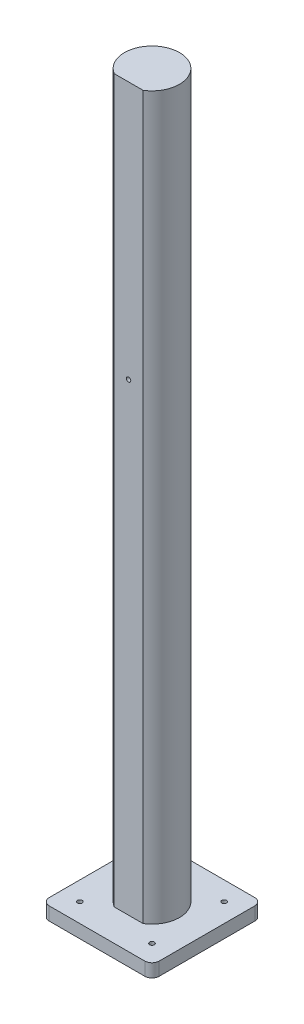
ISO-10303-21;
HEADER;
FILE_DESCRIPTION(('STEP AP214'),'2;1');
FILE_NAME('part.step','',(''),(''),'','','');
FILE_SCHEMA(('AUTOMOTIVE_DESIGN { 1 0 10303 214 1 1 1 1 }'));
ENDSEC;
DATA;
#1=APPLICATION_CONTEXT('core data for automotive mechanical design processes');
#2=APPLICATION_PROTOCOL_DEFINITION('international standard','automotive_design',2000,#1);
#3=PRODUCT_CONTEXT('',#1,'mechanical');
#4=PRODUCT('Part','Part','',(#3));
#5=PRODUCT_RELATED_PRODUCT_CATEGORY('part','',(#4));
#6=PRODUCT_DEFINITION_FORMATION('','',#4);
#7=PRODUCT_DEFINITION_CONTEXT('part definition',#1,'design');
#8=PRODUCT_DEFINITION('design','',#6,#7);
#9=PRODUCT_DEFINITION_SHAPE('','',#8);
#10=(LENGTH_UNIT() NAMED_UNIT(*) SI_UNIT(.MILLI.,.METRE.));
#11=(NAMED_UNIT(*) PLANE_ANGLE_UNIT() SI_UNIT($,.RADIAN.));
#12=(NAMED_UNIT(*) SI_UNIT($,.STERADIAN.) SOLID_ANGLE_UNIT());
#13=UNCERTAINTY_MEASURE_WITH_UNIT(LENGTH_MEASURE(1.E-05),#10,'distance_accuracy_value','');
#14=(GEOMETRIC_REPRESENTATION_CONTEXT(3) GLOBAL_UNCERTAINTY_ASSIGNED_CONTEXT((#13)) GLOBAL_UNIT_ASSIGNED_CONTEXT((#10,
#11,#12)) REPRESENTATION_CONTEXT('',''));
#15=CARTESIAN_POINT('',(0.,0.,0.));
#16=DIRECTION('',(0.,0.,1.));
#17=DIRECTION('',(1.,0.,0.));
#18=AXIS2_PLACEMENT_3D('',#15,#16,#17);
#19=CARTESIAN_POINT('',(0.,500.,0.));
#20=DIRECTION('',(0.,-1.,0.));
#21=DIRECTION('',(0.,0.,-1.));
#22=AXIS2_PLACEMENT_3D('',#19,#20,#21);
#23=CYLINDRICAL_SURFACE('',#22,19.05);
#24=CARTESIAN_POINT('',(0.,0.,0.));
#25=DIRECTION('',(0.,1.,0.));
#26=DIRECTION('',(0.,0.,1.));
#27=AXIS2_PLACEMENT_3D('',#24,#25,#26);
#28=CIRCLE('',#27,19.05);
#29=CARTESIAN_POINT('',(10.,0.,16.2142684077944));
#30=VERTEX_POINT('',#29);
#31=CARTESIAN_POINT('',(-10.,0.,16.2142684077944));
#32=VERTEX_POINT('',#31);
#33=EDGE_CURVE('E122',#30,#32,#28,.T.);
#34=ORIENTED_EDGE('',*,*,#33,.T.);
#35=DIRECTION('',(0.,-1.,0.));
#36=VECTOR('',#35,1.);
#37=CARTESIAN_POINT('',(-10.,500.,16.2142684077944));
#38=LINE('',#37,#36);
#39=CARTESIAN_POINT('',(-10.,500.,16.2142684077944));
#40=VERTEX_POINT('',#39);
#41=EDGE_CURVE('E129',#40,#32,#38,.T.);
#42=ORIENTED_EDGE('',*,*,#41,.F.);
#43=CARTESIAN_POINT('',(0.,500.,0.));
#44=DIRECTION('',(0.,1.,0.));
#45=DIRECTION('',(0.,0.,1.));
#46=AXIS2_PLACEMENT_3D('',#43,#44,#45);
#47=CIRCLE('',#46,19.05);
#48=CARTESIAN_POINT('',(10.,500.,16.2142684077944));
#49=VERTEX_POINT('',#48);
#50=EDGE_CURVE('E126',#49,#40,#47,.T.);
#51=ORIENTED_EDGE('',*,*,#50,.F.);
#52=DIRECTION('',(0.,-1.,0.));
#53=VECTOR('',#52,1.);
#54=CARTESIAN_POINT('',(10.,500.,16.2142684077944));
#55=LINE('',#54,#53);
#56=EDGE_CURVE('E136',#49,#30,#55,.T.);
#57=ORIENTED_EDGE('',*,*,#56,.T.);
#58=EDGE_LOOP('',(#34,#42,#51,#57));
#59=FACE_BOUND('',#58,.T.);
#60=ADVANCED_FACE('F40',(#59),#23,.T.);
#61=CARTESIAN_POINT('',(-10.,500.,16.2142684077944));
#62=DIRECTION('',(0.,0.,-1.));
#63=DIRECTION('',(-1.,0.,0.));
#64=AXIS2_PLACEMENT_3D('',#61,#62,#63);
#65=PLANE('',#64);
#66=CARTESIAN_POINT('',(0.,321.4,16.2142684077944));
#67=DIRECTION('',(0.,0.,1.));
#68=DIRECTION('',(1.,0.,0.));
#69=AXIS2_PLACEMENT_3D('',#66,#67,#68);
#70=CIRCLE('',#69,1.5);
#71=CARTESIAN_POINT('',(1.5,321.4,16.2142684077944));
#72=VERTEX_POINT('',#71);
#73=EDGE_CURVE('E141',#72,#72,#70,.T.);
#74=ORIENTED_EDGE('',*,*,#73,.F.);
#75=EDGE_LOOP('',(#74));
#76=FACE_BOUND('',#75,.T.);
#77=DIRECTION('',(1.,0.,0.));
#78=VECTOR('',#77,1.);
#79=CARTESIAN_POINT('',(-10.,0.,16.2142684077944));
#80=LINE('',#79,#78);
#81=EDGE_CURVE('E118',#32,#30,#80,.T.);
#82=ORIENTED_EDGE('',*,*,#81,.T.);
#83=ORIENTED_EDGE('',*,*,#56,.F.);
#84=DIRECTION('',(1.,0.,0.));
#85=VECTOR('',#84,1.);
#86=CARTESIAN_POINT('',(-10.,500.,16.2142684077944));
#87=LINE('',#86,#85);
#88=EDGE_CURVE('E131',#40,#49,#87,.T.);
#89=ORIENTED_EDGE('',*,*,#88,.F.);
#90=ORIENTED_EDGE('',*,*,#41,.T.);
#91=EDGE_LOOP('',(#82,#83,#89,#90));
#92=FACE_BOUND('',#91,.T.);
#93=ADVANCED_FACE('F130',(#76,#92),#65,.F.);
#94=CARTESIAN_POINT('',(0.,500.,0.));
#95=DIRECTION('',(0.,1.,0.));
#96=DIRECTION('',(0.,0.,1.));
#97=AXIS2_PLACEMENT_3D('',#94,#95,#96);
#98=PLANE('',#97);
#99=ORIENTED_EDGE('',*,*,#50,.T.);
#100=ORIENTED_EDGE('',*,*,#88,.T.);
#101=EDGE_LOOP('',(#99,#100));
#102=FACE_BOUND('',#101,.T.);
#103=ADVANCED_FACE('F214',(#102),#98,.T.);
#104=CARTESIAN_POINT('',(0.,321.4,11.2142684077944));
#105=DIRECTION('',(0.,0.,1.));
#106=DIRECTION('',(1.,0.,0.));
#107=AXIS2_PLACEMENT_3D('',#104,#105,#106);
#108=CYLINDRICAL_SURFACE('',#107,1.5);
#109=CARTESIAN_POINT('',(0.,321.4,11.2142684077944));
#110=DIRECTION('',(0.,0.,1.));
#111=DIRECTION('',(1.,0.,0.));
#112=AXIS2_PLACEMENT_3D('',#109,#110,#111);
#113=CIRCLE('',#112,1.5);
#114=CARTESIAN_POINT('',(1.5,321.4,11.2142684077944));
#115=VERTEX_POINT('',#114);
#116=EDGE_CURVE('E138',#115,#115,#113,.T.);
#117=ORIENTED_EDGE('',*,*,#116,.F.);
#118=EDGE_LOOP('',(#117));
#119=FACE_BOUND('',#118,.T.);
#120=ORIENTED_EDGE('',*,*,#73,.T.);
#121=EDGE_LOOP('',(#120));
#122=FACE_BOUND('',#121,.T.);
#123=ADVANCED_FACE('F216',(#119,#122),#108,.F.);
#124=CARTESIAN_POINT('',(0.,321.4,11.2142684077944));
#125=DIRECTION('',(0.,0.,1.));
#126=DIRECTION('',(1.,0.,0.));
#127=AXIS2_PLACEMENT_3D('',#124,#125,#126);
#128=PLANE('',#127);
#129=ORIENTED_EDGE('',*,*,#116,.T.);
#130=EDGE_LOOP('',(#129));
#131=FACE_BOUND('',#130,.T.);
#132=ADVANCED_FACE('F222',(#131),#128,.T.);
#133=CARTESIAN_POINT('',(0.,0.,0.));
#134=DIRECTION('',(0.,1.,0.));
#135=DIRECTION('',(0.,0.,1.));
#136=AXIS2_PLACEMENT_3D('',#133,#134,#135);
#137=PLANE('',#136);
#138=CARTESIAN_POINT('',(-25.,0.,-25.));
#139=DIRECTION('',(0.,1.,0.));
#140=DIRECTION('',(0.,0.,1.));
#141=AXIS2_PLACEMENT_3D('',#138,#139,#140);
#142=CIRCLE('',#141,1.65);
#143=CARTESIAN_POINT('',(-25.,0.,-23.35));
#144=VERTEX_POINT('',#143);
#145=EDGE_CURVE('E268',#144,#144,#142,.F.);
#146=ORIENTED_EDGE('',*,*,#145,.T.);
#147=EDGE_LOOP('',(#146));
#148=FACE_BOUND('',#147,.T.);
#149=CARTESIAN_POINT('',(25.,0.,25.));
#150=DIRECTION('',(0.,1.,0.));
#151=DIRECTION('',(0.,0.,1.));
#152=AXIS2_PLACEMENT_3D('',#149,#150,#151);
#153=CIRCLE('',#152,1.65);
#154=CARTESIAN_POINT('',(25.,0.,26.65));
#155=VERTEX_POINT('',#154);
#156=EDGE_CURVE('E269',#155,#155,#153,.F.);
#157=ORIENTED_EDGE('',*,*,#156,.T.);
#158=EDGE_LOOP('',(#157));
#159=FACE_BOUND('',#158,.T.);
#160=CARTESIAN_POINT('',(25.,0.,-25.));
#161=DIRECTION('',(0.,1.,0.));
#162=DIRECTION('',(0.,0.,1.));
#163=AXIS2_PLACEMENT_3D('',#160,#161,#162);
#164=CIRCLE('',#163,1.65);
#165=CARTESIAN_POINT('',(25.,0.,-23.35));
#166=VERTEX_POINT('',#165);
#167=EDGE_CURVE('E279',#166,#166,#164,.F.);
#168=ORIENTED_EDGE('',*,*,#167,.T.);
#169=EDGE_LOOP('',(#168));
#170=FACE_BOUND('',#169,.T.);
#171=CARTESIAN_POINT('',(-25.,0.,25.));
#172=DIRECTION('',(0.,1.,0.));
#173=DIRECTION('',(0.,0.,1.));
#174=AXIS2_PLACEMENT_3D('',#171,#172,#173);
#175=CIRCLE('',#174,1.65);
#176=CARTESIAN_POINT('',(-25.,0.,26.65));
#177=VERTEX_POINT('',#176);
#178=EDGE_CURVE('E206',#177,#177,#175,.F.);
#179=ORIENTED_EDGE('',*,*,#178,.T.);
#180=EDGE_LOOP('',(#179));
#181=FACE_BOUND('',#180,.T.);
#182=DIRECTION('',(0.,0.,-1.));
#183=VECTOR('',#182,1.);
#184=CARTESIAN_POINT('',(-38.1,0.,-38.1));
#185=LINE('',#184,#183);
#186=CARTESIAN_POINT('',(-38.1,0.,33.1));
#187=VERTEX_POINT('',#186);
#188=CARTESIAN_POINT('',(-38.1,0.,-33.1));
#189=VERTEX_POINT('',#188);
#190=EDGE_CURVE('E202',#187,#189,#185,.T.);
#191=ORIENTED_EDGE('',*,*,#190,.F.);
#192=CARTESIAN_POINT('',(-33.1,0.,33.1));
#193=DIRECTION('',(0.,1.,0.));
#194=DIRECTION('',(0.,0.,1.));
#195=AXIS2_PLACEMENT_3D('',#192,#193,#194);
#196=CIRCLE('',#195,5.);
#197=CARTESIAN_POINT('',(-33.1,0.,38.1));
#198=VERTEX_POINT('',#197);
#199=EDGE_CURVE('E157',#187,#198,#196,.T.);
#200=ORIENTED_EDGE('',*,*,#199,.T.);
#201=DIRECTION('',(-1.,0.,0.));
#202=VECTOR('',#201,1.);
#203=CARTESIAN_POINT('',(-38.1,0.,38.1));
#204=LINE('',#203,#202);
#205=CARTESIAN_POINT('',(33.1,0.,38.1));
#206=VERTEX_POINT('',#205);
#207=EDGE_CURVE('E198',#206,#198,#204,.T.);
#208=ORIENTED_EDGE('',*,*,#207,.F.);
#209=CARTESIAN_POINT('',(33.1,0.,33.1));
#210=DIRECTION('',(0.,1.,0.));
#211=DIRECTION('',(0.,0.,1.));
#212=AXIS2_PLACEMENT_3D('',#209,#210,#211);
#213=CIRCLE('',#212,5.);
#214=CARTESIAN_POINT('',(38.1,0.,33.1));
#215=VERTEX_POINT('',#214);
#216=EDGE_CURVE('E151',#206,#215,#213,.T.);
#217=ORIENTED_EDGE('',*,*,#216,.T.);
#218=DIRECTION('',(0.,0.,1.));
#219=VECTOR('',#218,1.);
#220=CARTESIAN_POINT('',(38.1,0.,-38.1));
#221=LINE('',#220,#219);
#222=CARTESIAN_POINT('',(38.1,0.,-33.1));
#223=VERTEX_POINT('',#222);
#224=EDGE_CURVE('E183',#223,#215,#221,.T.);
#225=ORIENTED_EDGE('',*,*,#224,.F.);
#226=CARTESIAN_POINT('',(33.1,0.,-33.1));
#227=DIRECTION('',(0.,1.,0.));
#228=DIRECTION('',(0.,0.,1.));
#229=AXIS2_PLACEMENT_3D('',#226,#227,#228);
#230=CIRCLE('',#229,5.);
#231=CARTESIAN_POINT('',(33.1,0.,-38.1));
#232=VERTEX_POINT('',#231);
#233=EDGE_CURVE('E153',#223,#232,#230,.T.);
#234=ORIENTED_EDGE('',*,*,#233,.T.);
#235=DIRECTION('',(1.,0.,0.));
#236=VECTOR('',#235,1.);
#237=CARTESIAN_POINT('',(-38.1,0.,-38.1));
#238=LINE('',#237,#236);
#239=CARTESIAN_POINT('',(-33.1,0.,-38.1));
#240=VERTEX_POINT('',#239);
#241=EDGE_CURVE('E191',#240,#232,#238,.T.);
#242=ORIENTED_EDGE('',*,*,#241,.F.);
#243=CARTESIAN_POINT('',(-33.1,0.,-33.1));
#244=DIRECTION('',(0.,1.,0.));
#245=DIRECTION('',(0.,0.,1.));
#246=AXIS2_PLACEMENT_3D('',#243,#244,#245);
#247=CIRCLE('',#246,5.);
#248=EDGE_CURVE('E155',#240,#189,#247,.T.);
#249=ORIENTED_EDGE('',*,*,#248,.T.);
#250=EDGE_LOOP('',(#191,#200,#208,#217,#225,#234,#242,#249));
#251=FACE_BOUND('',#250,.T.);
#252=ORIENTED_EDGE('',*,*,#33,.F.);
#253=ORIENTED_EDGE('',*,*,#81,.F.);
#254=EDGE_LOOP('',(#252,#253));
#255=FACE_BOUND('',#254,.T.);
#256=ADVANCED_FACE('F120',(#148,#159,#170,#181,#251,#255),#137,.T.);
#257=CARTESIAN_POINT('',(38.1,-9.144,-38.1));
#258=DIRECTION('',(-1.,0.,0.));
#259=DIRECTION('',(0.,0.,1.));
#260=AXIS2_PLACEMENT_3D('',#257,#258,#259);
#261=PLANE('',#260);
#262=DIRECTION('',(0.,0.,1.));
#263=VECTOR('',#262,1.);
#264=CARTESIAN_POINT('',(38.1,-9.144,-38.1));
#265=LINE('',#264,#263);
#266=CARTESIAN_POINT('',(38.1,-9.144,-33.1));
#267=VERTEX_POINT('',#266);
#268=CARTESIAN_POINT('',(38.1,-9.144,33.1));
#269=VERTEX_POINT('',#268);
#270=EDGE_CURVE('E180',#267,#269,#265,.T.);
#271=ORIENTED_EDGE('',*,*,#270,.F.);
#272=DIRECTION('',(0.,1.,0.));
#273=VECTOR('',#272,1.);
#274=CARTESIAN_POINT('',(38.1,-9.144,-33.1));
#275=LINE('',#274,#273);
#276=EDGE_CURVE('E11',#267,#223,#275,.T.);
#277=ORIENTED_EDGE('',*,*,#276,.T.);
#278=ORIENTED_EDGE('',*,*,#224,.T.);
#279=DIRECTION('',(0.,1.,0.));
#280=VECTOR('',#279,1.);
#281=CARTESIAN_POINT('',(38.1,-9.144,33.1));
#282=LINE('',#281,#280);
#283=EDGE_CURVE('E48',#215,#269,#282,.F.);
#284=ORIENTED_EDGE('',*,*,#283,.T.);
#285=EDGE_LOOP('',(#271,#277,#278,#284));
#286=FACE_BOUND('',#285,.T.);
#287=ADVANCED_FACE('F179',(#286),#261,.F.);
#288=CARTESIAN_POINT('',(-38.1,-9.144,38.1));
#289=DIRECTION('',(0.,0.,-1.));
#290=DIRECTION('',(-1.,0.,0.));
#291=AXIS2_PLACEMENT_3D('',#288,#289,#290);
#292=PLANE('',#291);
#293=ORIENTED_EDGE('',*,*,#207,.T.);
#294=DIRECTION('',(0.,1.,0.));
#295=VECTOR('',#294,1.);
#296=CARTESIAN_POINT('',(-33.1,-9.144,38.1));
#297=LINE('',#296,#295);
#298=CARTESIAN_POINT('',(-33.1,-9.144,38.1));
#299=VERTEX_POINT('',#298);
#300=EDGE_CURVE('E162',#198,#299,#297,.F.);
#301=ORIENTED_EDGE('',*,*,#300,.T.);
#302=DIRECTION('',(-1.,0.,0.));
#303=VECTOR('',#302,1.);
#304=CARTESIAN_POINT('',(-38.1,-9.144,38.1));
#305=LINE('',#304,#303);
#306=CARTESIAN_POINT('',(33.1,-9.144,38.1));
#307=VERTEX_POINT('',#306);
#308=EDGE_CURVE('E190',#307,#299,#305,.T.);
#309=ORIENTED_EDGE('',*,*,#308,.F.);
#310=DIRECTION('',(0.,1.,0.));
#311=VECTOR('',#310,1.);
#312=CARTESIAN_POINT('',(33.1,-9.144,38.1));
#313=LINE('',#312,#311);
#314=EDGE_CURVE('E159',#307,#206,#313,.T.);
#315=ORIENTED_EDGE('',*,*,#314,.T.);
#316=EDGE_LOOP('',(#293,#301,#309,#315));
#317=FACE_BOUND('',#316,.T.);
#318=ADVANCED_FACE('F197',(#317),#292,.F.);
#319=CARTESIAN_POINT('',(-38.1,-9.144,-38.1));
#320=DIRECTION('',(1.,0.,0.));
#321=DIRECTION('',(0.,0.,-1.));
#322=AXIS2_PLACEMENT_3D('',#319,#320,#321);
#323=PLANE('',#322);
#324=DIRECTION('',(0.,0.,-1.));
#325=VECTOR('',#324,1.);
#326=CARTESIAN_POINT('',(-38.1,-9.144,-38.1));
#327=LINE('',#326,#325);
#328=CARTESIAN_POINT('',(-38.1,-9.144,33.1));
#329=VERTEX_POINT('',#328);
#330=CARTESIAN_POINT('',(-38.1,-9.144,-33.1));
#331=VERTEX_POINT('',#330);
#332=EDGE_CURVE('E254',#329,#331,#327,.T.);
#333=ORIENTED_EDGE('',*,*,#332,.F.);
#334=DIRECTION('',(0.,1.,0.));
#335=VECTOR('',#334,1.);
#336=CARTESIAN_POINT('',(-38.1,-9.144,33.1));
#337=LINE('',#336,#335);
#338=EDGE_CURVE('E148',#329,#187,#337,.T.);
#339=ORIENTED_EDGE('',*,*,#338,.T.);
#340=ORIENTED_EDGE('',*,*,#190,.T.);
#341=DIRECTION('',(0.,1.,0.));
#342=VECTOR('',#341,1.);
#343=CARTESIAN_POINT('',(-38.1,-9.144,-33.1));
#344=LINE('',#343,#342);
#345=EDGE_CURVE('E135',#189,#331,#344,.F.);
#346=ORIENTED_EDGE('',*,*,#345,.T.);
#347=EDGE_LOOP('',(#333,#339,#340,#346));
#348=FACE_BOUND('',#347,.T.);
#349=ADVANCED_FACE('F252',(#348),#323,.F.);
#350=CARTESIAN_POINT('',(-38.1,-9.144,-38.1));
#351=DIRECTION('',(0.,0.,1.));
#352=DIRECTION('',(1.,0.,0.));
#353=AXIS2_PLACEMENT_3D('',#350,#351,#352);
#354=PLANE('',#353);
#355=DIRECTION('',(1.,0.,0.));
#356=VECTOR('',#355,1.);
#357=CARTESIAN_POINT('',(-38.1,-9.144,-38.1));
#358=LINE('',#357,#356);
#359=CARTESIAN_POINT('',(-33.1,-9.144,-38.1));
#360=VERTEX_POINT('',#359);
#361=CARTESIAN_POINT('',(33.1,-9.144,-38.1));
#362=VERTEX_POINT('',#361);
#363=EDGE_CURVE('E212',#360,#362,#358,.T.);
#364=ORIENTED_EDGE('',*,*,#363,.F.);
#365=DIRECTION('',(0.,1.,0.));
#366=VECTOR('',#365,1.);
#367=CARTESIAN_POINT('',(-33.1,-9.144,-38.1));
#368=LINE('',#367,#366);
#369=EDGE_CURVE('E172',#360,#240,#368,.T.);
#370=ORIENTED_EDGE('',*,*,#369,.T.);
#371=ORIENTED_EDGE('',*,*,#241,.T.);
#372=DIRECTION('',(0.,1.,0.));
#373=VECTOR('',#372,1.);
#374=CARTESIAN_POINT('',(33.1,-9.144,-38.1));
#375=LINE('',#374,#373);
#376=EDGE_CURVE('E55',#232,#362,#375,.F.);
#377=ORIENTED_EDGE('',*,*,#376,.T.);
#378=EDGE_LOOP('',(#364,#370,#371,#377));
#379=FACE_BOUND('',#378,.T.);
#380=ADVANCED_FACE('F247',(#379),#354,.F.);
#381=CARTESIAN_POINT('',(0.,-9.144,0.));
#382=DIRECTION('',(0.,1.,0.));
#383=DIRECTION('',(0.,0.,1.));
#384=AXIS2_PLACEMENT_3D('',#381,#382,#383);
#385=PLANE('',#384);
#386=CARTESIAN_POINT('',(-25.,-9.144,-25.));
#387=DIRECTION('',(0.,-1.,0.));
#388=DIRECTION('',(0.,0.,-1.));
#389=AXIS2_PLACEMENT_3D('',#386,#387,#388);
#390=CIRCLE('',#389,1.65);
#391=CARTESIAN_POINT('',(-25.,-9.144,-26.65));
#392=VERTEX_POINT('',#391);
#393=EDGE_CURVE('E264',#392,#392,#390,.T.);
#394=ORIENTED_EDGE('',*,*,#393,.F.);
#395=EDGE_LOOP('',(#394));
#396=FACE_BOUND('',#395,.T.);
#397=CARTESIAN_POINT('',(25.,-9.144,25.));
#398=DIRECTION('',(0.,-1.,0.));
#399=DIRECTION('',(0.,0.,-1.));
#400=AXIS2_PLACEMENT_3D('',#397,#398,#399);
#401=CIRCLE('',#400,1.65);
#402=CARTESIAN_POINT('',(25.,-9.144,23.35));
#403=VERTEX_POINT('',#402);
#404=EDGE_CURVE('E265',#403,#403,#401,.T.);
#405=ORIENTED_EDGE('',*,*,#404,.F.);
#406=EDGE_LOOP('',(#405));
#407=FACE_BOUND('',#406,.T.);
#408=CARTESIAN_POINT('',(25.,-9.144,-25.));
#409=DIRECTION('',(0.,-1.,0.));
#410=DIRECTION('',(0.,0.,-1.));
#411=AXIS2_PLACEMENT_3D('',#408,#409,#410);
#412=CIRCLE('',#411,1.65);
#413=CARTESIAN_POINT('',(25.,-9.144,-26.65));
#414=VERTEX_POINT('',#413);
#415=EDGE_CURVE('E272',#414,#414,#412,.T.);
#416=ORIENTED_EDGE('',*,*,#415,.F.);
#417=EDGE_LOOP('',(#416));
#418=FACE_BOUND('',#417,.T.);
#419=CARTESIAN_POINT('',(-25.,-9.144,25.));
#420=DIRECTION('',(0.,-1.,0.));
#421=DIRECTION('',(0.,0.,-1.));
#422=AXIS2_PLACEMENT_3D('',#419,#420,#421);
#423=CIRCLE('',#422,1.65);
#424=CARTESIAN_POINT('',(-25.,-9.144,23.35));
#425=VERTEX_POINT('',#424);
#426=EDGE_CURVE('E261',#425,#425,#423,.T.);
#427=ORIENTED_EDGE('',*,*,#426,.F.);
#428=EDGE_LOOP('',(#427));
#429=FACE_BOUND('',#428,.T.);
#430=ORIENTED_EDGE('',*,*,#308,.T.);
#431=CARTESIAN_POINT('',(-33.1,-9.144,33.1));
#432=DIRECTION('',(0.,1.,0.));
#433=DIRECTION('',(0.,0.,1.));
#434=AXIS2_PLACEMENT_3D('',#431,#432,#433);
#435=CIRCLE('',#434,5.);
#436=EDGE_CURVE('E169',#299,#329,#435,.F.);
#437=ORIENTED_EDGE('',*,*,#436,.T.);
#438=ORIENTED_EDGE('',*,*,#332,.T.);
#439=CARTESIAN_POINT('',(-33.1,-9.144,-33.1));
#440=DIRECTION('',(0.,1.,0.));
#441=DIRECTION('',(0.,0.,1.));
#442=AXIS2_PLACEMENT_3D('',#439,#440,#441);
#443=CIRCLE('',#442,5.);
#444=EDGE_CURVE('E62',#331,#360,#443,.F.);
#445=ORIENTED_EDGE('',*,*,#444,.T.);
#446=ORIENTED_EDGE('',*,*,#363,.T.);
#447=CARTESIAN_POINT('',(33.1,-9.144,-33.1));
#448=DIRECTION('',(0.,1.,0.));
#449=DIRECTION('',(0.,0.,1.));
#450=AXIS2_PLACEMENT_3D('',#447,#448,#449);
#451=CIRCLE('',#450,5.);
#452=EDGE_CURVE('E166',#362,#267,#451,.F.);
#453=ORIENTED_EDGE('',*,*,#452,.T.);
#454=ORIENTED_EDGE('',*,*,#270,.T.);
#455=CARTESIAN_POINT('',(33.1,-9.144,33.1));
#456=DIRECTION('',(0.,1.,0.));
#457=DIRECTION('',(0.,0.,1.));
#458=AXIS2_PLACEMENT_3D('',#455,#456,#457);
#459=CIRCLE('',#458,5.);
#460=EDGE_CURVE('E164',#269,#307,#459,.F.);
#461=ORIENTED_EDGE('',*,*,#460,.T.);
#462=EDGE_LOOP('',(#430,#437,#438,#445,#446,#453,#454,#461));
#463=FACE_BOUND('',#462,.T.);
#464=ADVANCED_FACE('F187',(#396,#407,#418,#429,#463),#385,.F.);
#465=CARTESIAN_POINT('',(-25.,4.66690475583121,25.));
#466=DIRECTION('',(0.,-1.,0.));
#467=DIRECTION('',(0.,0.,-1.));
#468=AXIS2_PLACEMENT_3D('',#465,#466,#467);
#469=CYLINDRICAL_SURFACE('',#468,1.65);
#470=ORIENTED_EDGE('',*,*,#426,.T.);
#471=EDGE_LOOP('',(#470));
#472=FACE_BOUND('',#471,.T.);
#473=ORIENTED_EDGE('',*,*,#178,.F.);
#474=EDGE_LOOP('',(#473));
#475=FACE_BOUND('',#474,.T.);
#476=ADVANCED_FACE('F288',(#472,#475),#469,.F.);
#477=CARTESIAN_POINT('',(25.,4.66690475583121,-25.));
#478=DIRECTION('',(0.,-1.,0.));
#479=DIRECTION('',(0.,0.,-1.));
#480=AXIS2_PLACEMENT_3D('',#477,#478,#479);
#481=CYLINDRICAL_SURFACE('',#480,1.65);
#482=ORIENTED_EDGE('',*,*,#415,.T.);
#483=EDGE_LOOP('',(#482));
#484=FACE_BOUND('',#483,.T.);
#485=ORIENTED_EDGE('',*,*,#167,.F.);
#486=EDGE_LOOP('',(#485));
#487=FACE_BOUND('',#486,.T.);
#488=ADVANCED_FACE('F285',(#484,#487),#481,.F.);
#489=CARTESIAN_POINT('',(25.,4.66690475583121,25.));
#490=DIRECTION('',(0.,-1.,0.));
#491=DIRECTION('',(0.,0.,-1.));
#492=AXIS2_PLACEMENT_3D('',#489,#490,#491);
#493=CYLINDRICAL_SURFACE('',#492,1.65);
#494=ORIENTED_EDGE('',*,*,#404,.T.);
#495=EDGE_LOOP('',(#494));
#496=FACE_BOUND('',#495,.T.);
#497=ORIENTED_EDGE('',*,*,#156,.F.);
#498=EDGE_LOOP('',(#497));
#499=FACE_BOUND('',#498,.T.);
#500=ADVANCED_FACE('F287',(#496,#499),#493,.F.);
#501=CARTESIAN_POINT('',(-25.,4.66690475583121,-25.));
#502=DIRECTION('',(0.,-1.,0.));
#503=DIRECTION('',(0.,0.,-1.));
#504=AXIS2_PLACEMENT_3D('',#501,#502,#503);
#505=CYLINDRICAL_SURFACE('',#504,1.65);
#506=ORIENTED_EDGE('',*,*,#393,.T.);
#507=EDGE_LOOP('',(#506));
#508=FACE_BOUND('',#507,.T.);
#509=ORIENTED_EDGE('',*,*,#145,.F.);
#510=EDGE_LOOP('',(#509));
#511=FACE_BOUND('',#510,.T.);
#512=ADVANCED_FACE('F236',(#508,#511),#505,.F.);
#513=CARTESIAN_POINT('',(-33.1,-9.144,33.1));
#514=DIRECTION('',(0.,1.,0.));
#515=DIRECTION('',(0.,0.,1.));
#516=AXIS2_PLACEMENT_3D('',#513,#514,#515);
#517=CYLINDRICAL_SURFACE('',#516,5.);
#518=ORIENTED_EDGE('',*,*,#436,.F.);
#519=ORIENTED_EDGE('',*,*,#300,.F.);
#520=ORIENTED_EDGE('',*,*,#199,.F.);
#521=ORIENTED_EDGE('',*,*,#338,.F.);
#522=EDGE_LOOP('',(#518,#519,#520,#521));
#523=FACE_BOUND('',#522,.T.);
#524=ADVANCED_FACE('F232',(#523),#517,.T.);
#525=CARTESIAN_POINT('',(-33.1,-9.144,-33.1));
#526=DIRECTION('',(0.,1.,0.));
#527=DIRECTION('',(0.,0.,1.));
#528=AXIS2_PLACEMENT_3D('',#525,#526,#527);
#529=CYLINDRICAL_SURFACE('',#528,5.);
#530=ORIENTED_EDGE('',*,*,#444,.F.);
#531=ORIENTED_EDGE('',*,*,#345,.F.);
#532=ORIENTED_EDGE('',*,*,#248,.F.);
#533=ORIENTED_EDGE('',*,*,#369,.F.);
#534=EDGE_LOOP('',(#530,#531,#532,#533));
#535=FACE_BOUND('',#534,.T.);
#536=ADVANCED_FACE('F235',(#535),#529,.T.);
#537=CARTESIAN_POINT('',(33.1,-9.144,-33.1));
#538=DIRECTION('',(0.,1.,0.));
#539=DIRECTION('',(0.,0.,1.));
#540=AXIS2_PLACEMENT_3D('',#537,#538,#539);
#541=CYLINDRICAL_SURFACE('',#540,5.);
#542=ORIENTED_EDGE('',*,*,#452,.F.);
#543=ORIENTED_EDGE('',*,*,#376,.F.);
#544=ORIENTED_EDGE('',*,*,#233,.F.);
#545=ORIENTED_EDGE('',*,*,#276,.F.);
#546=EDGE_LOOP('',(#542,#543,#544,#545));
#547=FACE_BOUND('',#546,.T.);
#548=ADVANCED_FACE('F239',(#547),#541,.T.);
#549=CARTESIAN_POINT('',(33.1,-9.144,33.1));
#550=DIRECTION('',(0.,1.,0.));
#551=DIRECTION('',(0.,0.,1.));
#552=AXIS2_PLACEMENT_3D('',#549,#550,#551);
#553=CYLINDRICAL_SURFACE('',#552,5.);
#554=ORIENTED_EDGE('',*,*,#460,.F.);
#555=ORIENTED_EDGE('',*,*,#283,.F.);
#556=ORIENTED_EDGE('',*,*,#216,.F.);
#557=ORIENTED_EDGE('',*,*,#314,.F.);
#558=EDGE_LOOP('',(#554,#555,#556,#557));
#559=FACE_BOUND('',#558,.T.);
#560=ADVANCED_FACE('F42',(#559),#553,.T.);
#561=CLOSED_SHELL('',(#60,#93,#103,#123,#132,#256,#287,#318,#349,#380,#464,#476,#488,#500,#512,
#524,#536,#548,#560));
#562=MANIFOLD_SOLID_BREP('B2',#561);
#563=ADVANCED_BREP_SHAPE_REPRESENTATION('',(#18,#562),#14);
#564=SHAPE_DEFINITION_REPRESENTATION(#9,#563);
ENDSEC;
END-ISO-10303-21;
